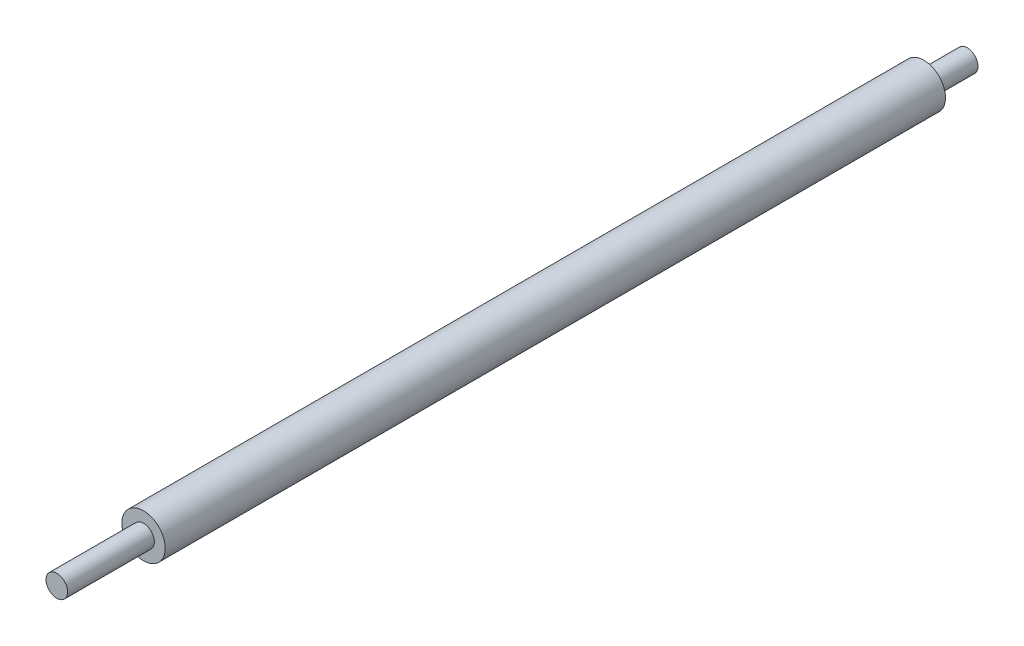
ISO-10303-21;
HEADER;
FILE_DESCRIPTION(('STEP AP214'),'2;1');
FILE_NAME('part.step','',(''),(''),'','','');
FILE_SCHEMA(('AUTOMOTIVE_DESIGN { 1 0 10303 214 1 1 1 1 }'));
ENDSEC;
DATA;
#1=APPLICATION_CONTEXT('core data for automotive mechanical design processes');
#2=APPLICATION_PROTOCOL_DEFINITION('international standard','automotive_design',2000,#1);
#3=PRODUCT_CONTEXT('',#1,'mechanical');
#4=PRODUCT('Part','Part','',(#3));
#5=PRODUCT_RELATED_PRODUCT_CATEGORY('part','',(#4));
#6=PRODUCT_DEFINITION_FORMATION('','',#4);
#7=PRODUCT_DEFINITION_CONTEXT('part definition',#1,'design');
#8=PRODUCT_DEFINITION('design','',#6,#7);
#9=PRODUCT_DEFINITION_SHAPE('','',#8);
#10=(LENGTH_UNIT() NAMED_UNIT(*) SI_UNIT(.MILLI.,.METRE.));
#11=(NAMED_UNIT(*) PLANE_ANGLE_UNIT() SI_UNIT($,.RADIAN.));
#12=(NAMED_UNIT(*) SI_UNIT($,.STERADIAN.) SOLID_ANGLE_UNIT());
#13=UNCERTAINTY_MEASURE_WITH_UNIT(LENGTH_MEASURE(1.E-05),#10,'distance_accuracy_value','');
#14=(GEOMETRIC_REPRESENTATION_CONTEXT(3) GLOBAL_UNCERTAINTY_ASSIGNED_CONTEXT((#13)) GLOBAL_UNIT_ASSIGNED_CONTEXT((#10,
#11,#12)) REPRESENTATION_CONTEXT('',''));
#15=CARTESIAN_POINT('',(0.,0.,0.));
#16=DIRECTION('',(0.,0.,1.));
#17=DIRECTION('',(1.,0.,0.));
#18=AXIS2_PLACEMENT_3D('',#15,#16,#17);
#19=CARTESIAN_POINT('',(0.,0.,0.));
#20=DIRECTION('',(0.,0.,1.));
#21=DIRECTION('',(1.,0.,0.));
#22=AXIS2_PLACEMENT_3D('',#19,#20,#21);
#23=PLANE('',#22);
#24=CARTESIAN_POINT('',(0.,0.,0.));
#25=DIRECTION('',(0.,0.,1.));
#26=DIRECTION('',(1.,0.,0.));
#27=AXIS2_PLACEMENT_3D('',#24,#25,#26);
#28=CIRCLE('',#27,5.);
#29=CARTESIAN_POINT('',(5.,0.,0.));
#30=VERTEX_POINT('',#29);
#31=EDGE_CURVE('E39',#30,#30,#28,.T.);
#32=ORIENTED_EDGE('',*,*,#31,.F.);
#33=EDGE_LOOP('',(#32));
#34=FACE_BOUND('',#33,.T.);
#35=CARTESIAN_POINT('',(0.,0.,0.));
#36=DIRECTION('',(0.,0.,1.));
#37=DIRECTION('',(1.,0.,0.));
#38=AXIS2_PLACEMENT_3D('',#35,#36,#37);
#39=CIRCLE('',#38,2.5);
#40=CARTESIAN_POINT('',(2.5,0.,0.));
#41=VERTEX_POINT('',#40);
#42=EDGE_CURVE('E10',#41,#41,#39,.F.);
#43=ORIENTED_EDGE('',*,*,#42,.F.);
#44=EDGE_LOOP('',(#43));
#45=FACE_BOUND('',#44,.T.);
#46=ADVANCED_FACE('F28',(#34,#45),#23,.F.);
#47=CARTESIAN_POINT('',(0.,0.,180.));
#48=DIRECTION('',(0.,0.,1.));
#49=DIRECTION('',(1.,0.,0.));
#50=AXIS2_PLACEMENT_3D('',#47,#48,#49);
#51=PLANE('',#50);
#52=CARTESIAN_POINT('',(0.,0.,180.));
#53=DIRECTION('',(0.,0.,1.));
#54=DIRECTION('',(1.,0.,0.));
#55=AXIS2_PLACEMENT_3D('',#52,#53,#54);
#56=CIRCLE('',#55,5.);
#57=CARTESIAN_POINT('',(5.,0.,180.));
#58=VERTEX_POINT('',#57);
#59=EDGE_CURVE('E35',#58,#58,#56,.T.);
#60=ORIENTED_EDGE('',*,*,#59,.T.);
#61=EDGE_LOOP('',(#60));
#62=FACE_BOUND('',#61,.T.);
#63=CARTESIAN_POINT('',(0.,0.,180.));
#64=DIRECTION('',(0.,0.,1.));
#65=DIRECTION('',(1.,0.,0.));
#66=AXIS2_PLACEMENT_3D('',#63,#64,#65);
#67=CIRCLE('',#66,2.5);
#68=CARTESIAN_POINT('',(2.5,0.,180.));
#69=VERTEX_POINT('',#68);
#70=EDGE_CURVE('E46',#69,#69,#67,.T.);
#71=ORIENTED_EDGE('',*,*,#70,.F.);
#72=EDGE_LOOP('',(#71));
#73=FACE_BOUND('',#72,.T.);
#74=ADVANCED_FACE('F70',(#62,#73),#51,.T.);
#75=CARTESIAN_POINT('',(0.,0.,180.));
#76=DIRECTION('',(0.,0.,-1.));
#77=DIRECTION('',(-1.,0.,0.));
#78=AXIS2_PLACEMENT_3D('',#75,#76,#77);
#79=CYLINDRICAL_SURFACE('',#78,5.);
#80=ORIENTED_EDGE('',*,*,#59,.F.);
#81=EDGE_LOOP('',(#80));
#82=FACE_BOUND('',#81,.T.);
#83=ORIENTED_EDGE('',*,*,#31,.T.);
#84=EDGE_LOOP('',(#83));
#85=FACE_BOUND('',#84,.T.);
#86=ADVANCED_FACE('F30',(#82,#85),#79,.T.);
#87=CARTESIAN_POINT('',(0.,0.,200.));
#88=DIRECTION('',(0.,0.,-1.));
#89=DIRECTION('',(-1.,0.,0.));
#90=AXIS2_PLACEMENT_3D('',#87,#88,#89);
#91=CYLINDRICAL_SURFACE('',#90,2.5);
#92=CARTESIAN_POINT('',(0.,0.,200.));
#93=DIRECTION('',(0.,0.,1.));
#94=DIRECTION('',(1.,0.,0.));
#95=AXIS2_PLACEMENT_3D('',#92,#93,#94);
#96=CIRCLE('',#95,2.5);
#97=CARTESIAN_POINT('',(2.5,0.,200.));
#98=VERTEX_POINT('',#97);
#99=EDGE_CURVE('E44',#98,#98,#96,.T.);
#100=ORIENTED_EDGE('',*,*,#99,.F.);
#101=EDGE_LOOP('',(#100));
#102=FACE_BOUND('',#101,.T.);
#103=ORIENTED_EDGE('',*,*,#70,.T.);
#104=EDGE_LOOP('',(#103));
#105=FACE_BOUND('',#104,.T.);
#106=ADVANCED_FACE('F66',(#102,#105),#91,.T.);
#107=CARTESIAN_POINT('',(0.,0.,200.));
#108=DIRECTION('',(0.,0.,1.));
#109=DIRECTION('',(1.,0.,0.));
#110=AXIS2_PLACEMENT_3D('',#107,#108,#109);
#111=PLANE('',#110);
#112=ORIENTED_EDGE('',*,*,#99,.T.);
#113=EDGE_LOOP('',(#112));
#114=FACE_BOUND('',#113,.T.);
#115=ADVANCED_FACE('F59',(#114),#111,.T.);
#116=CARTESIAN_POINT('',(0.,0.,-10.));
#117=DIRECTION('',(0.,0.,1.));
#118=DIRECTION('',(1.,0.,0.));
#119=AXIS2_PLACEMENT_3D('',#116,#117,#118);
#120=CYLINDRICAL_SURFACE('',#119,2.5);
#121=CARTESIAN_POINT('',(0.,0.,-10.));
#122=DIRECTION('',(0.,0.,-1.));
#123=DIRECTION('',(-1.,0.,0.));
#124=AXIS2_PLACEMENT_3D('',#121,#122,#123);
#125=CIRCLE('',#124,2.5);
#126=CARTESIAN_POINT('',(-2.5,0.,-10.));
#127=VERTEX_POINT('',#126);
#128=EDGE_CURVE('E49',#127,#127,#125,.T.);
#129=ORIENTED_EDGE('',*,*,#128,.F.);
#130=EDGE_LOOP('',(#129));
#131=FACE_BOUND('',#130,.T.);
#132=ORIENTED_EDGE('',*,*,#42,.T.);
#133=EDGE_LOOP('',(#132));
#134=FACE_BOUND('',#133,.T.);
#135=ADVANCED_FACE('F57',(#131,#134),#120,.T.);
#136=CARTESIAN_POINT('',(0.,0.,-10.));
#137=DIRECTION('',(0.,0.,-1.));
#138=DIRECTION('',(-1.,0.,0.));
#139=AXIS2_PLACEMENT_3D('',#136,#137,#138);
#140=PLANE('',#139);
#141=ORIENTED_EDGE('',*,*,#128,.T.);
#142=EDGE_LOOP('',(#141));
#143=FACE_BOUND('',#142,.T.);
#144=ADVANCED_FACE('F55',(#143),#140,.T.);
#145=CLOSED_SHELL('',(#46,#74,#86,#106,#115,#135,#144));
#146=MANIFOLD_SOLID_BREP('B2',#145);
#147=ADVANCED_BREP_SHAPE_REPRESENTATION('',(#18,#146),#14);
#148=SHAPE_DEFINITION_REPRESENTATION(#9,#147);
ENDSEC;
END-ISO-10303-21;
